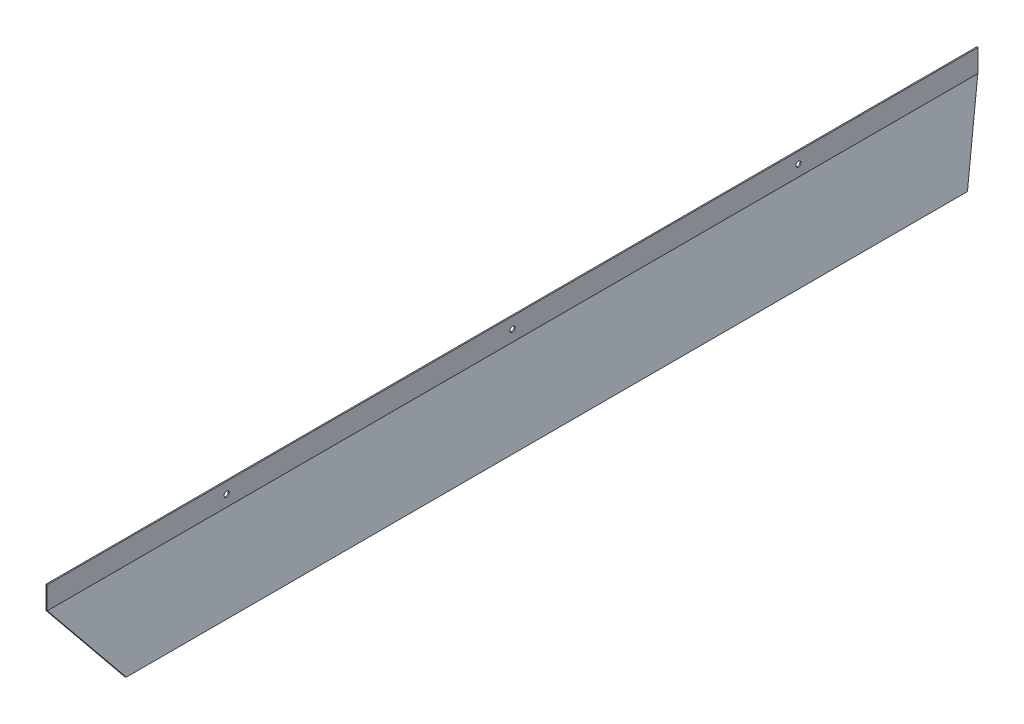
ISO-10303-21;
HEADER;
FILE_DESCRIPTION(('STEP AP214'),'2;1');
FILE_NAME('part.step','',(''),(''),'','','');
FILE_SCHEMA(('AUTOMOTIVE_DESIGN { 1 0 10303 214 1 1 1 1 }'));
ENDSEC;
DATA;
#1=APPLICATION_CONTEXT('core data for automotive mechanical design processes');
#2=APPLICATION_PROTOCOL_DEFINITION('international standard','automotive_design',2000,#1);
#3=PRODUCT_CONTEXT('',#1,'mechanical');
#4=PRODUCT('Part','Part','',(#3));
#5=PRODUCT_RELATED_PRODUCT_CATEGORY('part','',(#4));
#6=PRODUCT_DEFINITION_FORMATION('','',#4);
#7=PRODUCT_DEFINITION_CONTEXT('part definition',#1,'design');
#8=PRODUCT_DEFINITION('design','',#6,#7);
#9=PRODUCT_DEFINITION_SHAPE('','',#8);
#10=(LENGTH_UNIT() NAMED_UNIT(*) SI_UNIT(.MILLI.,.METRE.));
#11=(NAMED_UNIT(*) PLANE_ANGLE_UNIT() SI_UNIT($,.RADIAN.));
#12=(NAMED_UNIT(*) SI_UNIT($,.STERADIAN.) SOLID_ANGLE_UNIT());
#13=UNCERTAINTY_MEASURE_WITH_UNIT(LENGTH_MEASURE(1.E-05),#10,'distance_accuracy_value','');
#14=(GEOMETRIC_REPRESENTATION_CONTEXT(3) GLOBAL_UNCERTAINTY_ASSIGNED_CONTEXT((#13)) GLOBAL_UNIT_ASSIGNED_CONTEXT((#10,
#11,#12)) REPRESENTATION_CONTEXT('',''));
#15=CARTESIAN_POINT('',(0.,0.,0.));
#16=DIRECTION('',(0.,0.,1.));
#17=DIRECTION('',(1.,0.,0.));
#18=AXIS2_PLACEMENT_3D('',#15,#16,#17);
#19=CARTESIAN_POINT('',(0.,0.,-1628.));
#20=DIRECTION('',(1.,0.,0.));
#21=DIRECTION('',(0.,0.,-1.));
#22=AXIS2_PLACEMENT_3D('',#19,#20,#21);
#23=PLANE('',#22);
#24=DIRECTION('',(0.,-0.876889628932195,0.480691770962596));
#25=VECTOR('',#24,1.);
#26=CARTESIAN_POINT('',(0.,0.134693205403793,-1627.75428937618));
#27=LINE('',#26,#25);
#28=CARTESIAN_POINT('',(0.,0.582924506120358,-1628.));
#29=VERTEX_POINT('',#28);
#30=CARTESIAN_POINT('',(0.,0.,-1627.68045349843));
#31=VERTEX_POINT('',#30);
#32=EDGE_CURVE('E164',#29,#31,#27,.T.);
#33=ORIENTED_EDGE('',*,*,#32,.F.);
#34=DIRECTION('',(0.,1.,0.));
#35=VECTOR('',#34,1.);
#36=CARTESIAN_POINT('',(0.,0.,-1628.));
#37=LINE('',#36,#35);
#38=CARTESIAN_POINT('',(0.,39.4886186999102,-1628.));
#39=VERTEX_POINT('',#38);
#40=EDGE_CURVE('E81',#29,#39,#37,.T.);
#41=ORIENTED_EDGE('',*,*,#40,.T.);
#42=DIRECTION('',(0.,0.,1.));
#43=VECTOR('',#42,1.);
#44=CARTESIAN_POINT('',(0.,39.4886186999102,-1628.));
#45=LINE('',#44,#43);
#46=CARTESIAN_POINT('',(0.,39.4886186999102,0.));
#47=VERTEX_POINT('',#46);
#48=EDGE_CURVE('E134',#39,#47,#45,.T.);
#49=ORIENTED_EDGE('',*,*,#48,.T.);
#50=DIRECTION('',(0.,1.,0.));
#51=VECTOR('',#50,1.);
#52=CARTESIAN_POINT('',(0.,0.,0.));
#53=LINE('',#52,#51);
#54=CARTESIAN_POINT('',(0.,0.582924506120357,0.));
#55=VERTEX_POINT('',#54);
#56=EDGE_CURVE('E147',#55,#47,#53,.T.);
#57=ORIENTED_EDGE('',*,*,#56,.F.);
#58=DIRECTION('',(0.,0.876889628932195,0.480691770962596));
#59=VECTOR('',#58,1.);
#60=CARTESIAN_POINT('',(0.,-686.089494269602,-376.418844700459));
#61=LINE('',#60,#59);
#62=CARTESIAN_POINT('',(0.,1.11022302462516E-13,-0.319546501565626));
#63=VERTEX_POINT('',#62);
#64=EDGE_CURVE('E51',#63,#55,#61,.T.);
#65=ORIENTED_EDGE('',*,*,#64,.F.);
#66=DIRECTION('',(0.,0.,1.));
#67=VECTOR('',#66,1.);
#68=CARTESIAN_POINT('',(0.,0.,-1628.));
#69=LINE('',#68,#67);
#70=EDGE_CURVE('E128',#31,#63,#69,.T.);
#71=ORIENTED_EDGE('',*,*,#70,.F.);
#72=EDGE_LOOP('',(#33,#41,#49,#57,#65,#71));
#73=FACE_BOUND('',#72,.T.);
#74=CARTESIAN_POINT('',(0.,19.7443093499552,-314.));
#75=DIRECTION('',(1.,0.,0.));
#76=DIRECTION('',(0.,0.,-1.));
#77=AXIS2_PLACEMENT_3D('',#74,#75,#76);
#78=CIRCLE('',#77,4.4999999999999);
#79=CARTESIAN_POINT('',(0.,19.7443093499552,-318.5));
#80=VERTEX_POINT('',#79);
#81=EDGE_CURVE('E167',#80,#80,#78,.T.);
#82=ORIENTED_EDGE('',*,*,#81,.F.);
#83=EDGE_LOOP('',(#82));
#84=FACE_BOUND('',#83,.T.);
#85=CARTESIAN_POINT('',(0.,19.7443093499553,-1314.));
#86=DIRECTION('',(1.,0.,0.));
#87=DIRECTION('',(0.,0.,1.));
#88=AXIS2_PLACEMENT_3D('',#85,#86,#87);
#89=CIRCLE('',#88,4.50000000000001);
#90=CARTESIAN_POINT('',(0.,19.7443093499553,-1309.5));
#91=VERTEX_POINT('',#90);
#92=EDGE_CURVE('E160',#91,#91,#89,.T.);
#93=ORIENTED_EDGE('',*,*,#92,.F.);
#94=EDGE_LOOP('',(#93));
#95=FACE_BOUND('',#94,.T.);
#96=CARTESIAN_POINT('',(0.,19.7443093499552,-814.));
#97=DIRECTION('',(1.,0.,0.));
#98=DIRECTION('',(0.,0.,-1.));
#99=AXIS2_PLACEMENT_3D('',#96,#97,#98);
#100=CIRCLE('',#99,4.49999999999991);
#101=CARTESIAN_POINT('',(0.,19.7443093499552,-818.5));
#102=VERTEX_POINT('',#101);
#103=EDGE_CURVE('E154',#102,#102,#100,.T.);
#104=ORIENTED_EDGE('',*,*,#103,.F.);
#105=EDGE_LOOP('',(#104));
#106=FACE_BOUND('',#105,.T.);
#107=ADVANCED_FACE('F37',(#73,#84,#95,#106),#23,.T.);
#108=CARTESIAN_POINT('',(0.,0.,-1628.));
#109=DIRECTION('',(0.877268487978452,0.48,0.));
#110=DIRECTION('',(-0.48,0.877268487978452,0.));
#111=AXIS2_PLACEMENT_3D('',#108,#109,#110);
#112=PLANE('',#111);
#113=DIRECTION('',(0.407063086155084,-0.743965871048152,0.529919264233206));
#114=VECTOR('',#113,1.);
#115=CARTESIAN_POINT('',(-0.068929558349506,0.125978602979778,-1627.77018676605));
#116=LINE('',#115,#114);
#117=CARTESIAN_POINT('',(60.,-109.658560997307,-1549.57178450977));
#118=VERTEX_POINT('',#117);
#119=EDGE_CURVE('E106',#31,#118,#116,.T.);
#120=ORIENTED_EDGE('',*,*,#119,.F.);
#121=ORIENTED_EDGE('',*,*,#70,.T.);
#122=DIRECTION('',(-0.407063086155084,0.743965871048152,0.529919264233206));
#123=VECTOR('',#122,1.);
#124=CARTESIAN_POINT('',(351.107880211662,-641.699748313758,-457.395699747648));
#125=LINE('',#124,#123);
#126=CARTESIAN_POINT('',(60.,-109.658560997307,-78.4282154902318));
#127=VERTEX_POINT('',#126);
#128=EDGE_CURVE('E111',#127,#63,#125,.T.);
#129=ORIENTED_EDGE('',*,*,#128,.F.);
#130=DIRECTION('',(0.,0.,1.));
#131=VECTOR('',#130,1.);
#132=CARTESIAN_POINT('',(60.,-109.658560997307,-1628.));
#133=LINE('',#132,#131);
#134=EDGE_CURVE('E126',#118,#127,#133,.T.);
#135=ORIENTED_EDGE('',*,*,#134,.F.);
#136=EDGE_LOOP('',(#120,#121,#129,#135));
#137=FACE_BOUND('',#136,.T.);
#138=ADVANCED_FACE('F191',(#137),#112,.T.);
#139=CARTESIAN_POINT('',(58.2454630240431,-110.618560997307,-1628.));
#140=DIRECTION('',(0.480000000000009,-0.877268487978447,0.));
#141=DIRECTION('',(0.877268487978448,0.480000000000009,0.));
#142=AXIS2_PLACEMENT_3D('',#139,#140,#141);
#143=PLANE('',#142);
#144=DIRECTION('',(-0.877268487978452,-0.48,0.));
#145=VECTOR('',#144,1.);
#146=CARTESIAN_POINT('',(67.0181479038277,-105.818560997307,-1549.57178450977));
#147=LINE('',#146,#145);
#148=CARTESIAN_POINT('',(58.2454630240431,-110.618560997307,-1549.57178450977));
#149=VERTEX_POINT('',#148);
#150=EDGE_CURVE('E103',#118,#149,#147,.T.);
#151=ORIENTED_EDGE('',*,*,#150,.F.);
#152=ORIENTED_EDGE('',*,*,#134,.T.);
#153=DIRECTION('',(-0.877268487978452,-0.48,0.));
#154=VECTOR('',#153,1.);
#155=CARTESIAN_POINT('',(67.0181479038277,-105.818560997307,-78.4282154902318));
#156=LINE('',#155,#154);
#157=CARTESIAN_POINT('',(58.2454630240431,-110.618560997307,-78.4282154902318));
#158=VERTEX_POINT('',#157);
#159=EDGE_CURVE('E122',#127,#158,#156,.T.);
#160=ORIENTED_EDGE('',*,*,#159,.T.);
#161=DIRECTION('',(0.,0.,1.));
#162=VECTOR('',#161,1.);
#163=CARTESIAN_POINT('',(58.2454630240431,-110.618560997307,-1628.));
#164=LINE('',#163,#162);
#165=EDGE_CURVE('E118',#149,#158,#164,.T.);
#166=ORIENTED_EDGE('',*,*,#165,.F.);
#167=EDGE_LOOP('',(#151,#152,#160,#166));
#168=FACE_BOUND('',#167,.T.);
#169=ADVANCED_FACE('F125',(#168),#143,.T.);
#170=CARTESIAN_POINT('',(-2.,-0.511381300089771,-1628.));
#171=DIRECTION('',(-0.877268487978452,-0.48,0.));
#172=DIRECTION('',(0.48,-0.877268487978452,0.));
#173=AXIS2_PLACEMENT_3D('',#170,#171,#172);
#174=PLANE('',#173);
#175=DIRECTION('',(-0.407063086155084,0.743965871048152,-0.529919264233206));
#176=VECTOR('',#175,1.);
#177=CARTESIAN_POINT('',(-2.,-0.511381300089771,-1628.));
#178=LINE('',#177,#176);
#179=CARTESIAN_POINT('',(-2.,-0.511381300089771,-1628.));
#180=VERTEX_POINT('',#179);
#181=EDGE_CURVE('E60',#149,#180,#178,.T.);
#182=ORIENTED_EDGE('',*,*,#181,.F.);
#183=ORIENTED_EDGE('',*,*,#165,.T.);
#184=DIRECTION('',(0.407063086155084,-0.743965871048152,-0.529919264233206));
#185=VECTOR('',#184,1.);
#186=CARTESIAN_POINT('',(-2.,-0.511381300089771,0.));
#187=LINE('',#186,#185);
#188=CARTESIAN_POINT('',(-2.,-0.511381300089771,0.));
#189=VERTEX_POINT('',#188);
#190=EDGE_CURVE('E177',#189,#158,#187,.T.);
#191=ORIENTED_EDGE('',*,*,#190,.F.);
#192=DIRECTION('',(0.,0.,1.));
#193=VECTOR('',#192,1.);
#194=CARTESIAN_POINT('',(-2.,-0.511381300089771,-1628.));
#195=LINE('',#194,#193);
#196=EDGE_CURVE('E120',#180,#189,#195,.T.);
#197=ORIENTED_EDGE('',*,*,#196,.F.);
#198=EDGE_LOOP('',(#182,#183,#191,#197));
#199=FACE_BOUND('',#198,.T.);
#200=ADVANCED_FACE('F116',(#199),#174,.T.);
#201=CARTESIAN_POINT('',(-2.,-0.511381300089771,-1628.));
#202=DIRECTION('',(-1.,0.,0.));
#203=DIRECTION('',(0.,0.,1.));
#204=AXIS2_PLACEMENT_3D('',#201,#202,#203);
#205=PLANE('',#204);
#206=CARTESIAN_POINT('',(-2.,19.7443093499552,-314.));
#207=DIRECTION('',(1.,0.,0.));
#208=DIRECTION('',(0.,0.,-1.));
#209=AXIS2_PLACEMENT_3D('',#206,#207,#208);
#210=CIRCLE('',#209,4.4999999999999);
#211=CARTESIAN_POINT('',(-2.,19.7443093499552,-318.5));
#212=VERTEX_POINT('',#211);
#213=EDGE_CURVE('E157',#212,#212,#210,.T.);
#214=ORIENTED_EDGE('',*,*,#213,.T.);
#215=EDGE_LOOP('',(#214));
#216=FACE_BOUND('',#215,.T.);
#217=CARTESIAN_POINT('',(-2.,19.7443093499553,-1314.));
#218=DIRECTION('',(1.,0.,0.));
#219=DIRECTION('',(0.,0.,1.));
#220=AXIS2_PLACEMENT_3D('',#217,#218,#219);
#221=CIRCLE('',#220,4.50000000000001);
#222=CARTESIAN_POINT('',(-2.,19.7443093499553,-1309.5));
#223=VERTEX_POINT('',#222);
#224=EDGE_CURVE('E163',#223,#223,#221,.T.);
#225=ORIENTED_EDGE('',*,*,#224,.T.);
#226=EDGE_LOOP('',(#225));
#227=FACE_BOUND('',#226,.T.);
#228=CARTESIAN_POINT('',(-2.,19.7443093499552,-814.));
#229=DIRECTION('',(1.,0.,0.));
#230=DIRECTION('',(0.,0.,-1.));
#231=AXIS2_PLACEMENT_3D('',#228,#229,#230);
#232=CIRCLE('',#231,4.49999999999991);
#233=CARTESIAN_POINT('',(-2.,19.7443093499552,-818.5));
#234=VERTEX_POINT('',#233);
#235=EDGE_CURVE('E149',#234,#234,#232,.T.);
#236=ORIENTED_EDGE('',*,*,#235,.T.);
#237=EDGE_LOOP('',(#236));
#238=FACE_BOUND('',#237,.T.);
#239=DIRECTION('',(0.,-1.,0.));
#240=VECTOR('',#239,1.);
#241=CARTESIAN_POINT('',(-2.,-0.511381300089771,0.));
#242=LINE('',#241,#240);
#243=CARTESIAN_POINT('',(-2.,39.4886186999102,0.));
#244=VERTEX_POINT('',#243);
#245=EDGE_CURVE('E141',#244,#189,#242,.T.);
#246=ORIENTED_EDGE('',*,*,#245,.F.);
#247=DIRECTION('',(0.,0.,1.));
#248=VECTOR('',#247,1.);
#249=CARTESIAN_POINT('',(-2.,39.4886186999102,-1628.));
#250=LINE('',#249,#248);
#251=CARTESIAN_POINT('',(-2.,39.4886186999102,-1628.));
#252=VERTEX_POINT('',#251);
#253=EDGE_CURVE('E74',#252,#244,#250,.T.);
#254=ORIENTED_EDGE('',*,*,#253,.F.);
#255=DIRECTION('',(0.,-1.,0.));
#256=VECTOR('',#255,1.);
#257=CARTESIAN_POINT('',(-2.,-0.511381300089771,-1628.));
#258=LINE('',#257,#256);
#259=EDGE_CURVE('E135',#252,#180,#258,.T.);
#260=ORIENTED_EDGE('',*,*,#259,.T.);
#261=ORIENTED_EDGE('',*,*,#196,.T.);
#262=EDGE_LOOP('',(#246,#254,#260,#261));
#263=FACE_BOUND('',#262,.T.);
#264=ADVANCED_FACE('F180',(#216,#227,#238,#263),#205,.T.);
#265=CARTESIAN_POINT('',(0.,39.4886186999102,-1628.));
#266=DIRECTION('',(0.,1.,0.));
#267=DIRECTION('',(-1.,0.,0.));
#268=AXIS2_PLACEMENT_3D('',#265,#266,#267);
#269=PLANE('',#268);
#270=DIRECTION('',(-1.,0.,0.));
#271=VECTOR('',#270,1.);
#272=CARTESIAN_POINT('',(0.,39.4886186999102,0.));
#273=LINE('',#272,#271);
#274=EDGE_CURVE('E144',#47,#244,#273,.T.);
#275=ORIENTED_EDGE('',*,*,#274,.F.);
#276=ORIENTED_EDGE('',*,*,#48,.F.);
#277=DIRECTION('',(-1.,0.,0.));
#278=VECTOR('',#277,1.);
#279=CARTESIAN_POINT('',(0.,39.4886186999102,-1628.));
#280=LINE('',#279,#278);
#281=EDGE_CURVE('E151',#39,#252,#280,.T.);
#282=ORIENTED_EDGE('',*,*,#281,.T.);
#283=ORIENTED_EDGE('',*,*,#253,.T.);
#284=EDGE_LOOP('',(#275,#276,#282,#283));
#285=FACE_BOUND('',#284,.T.);
#286=ADVANCED_FACE('F185',(#285),#269,.T.);
#287=CARTESIAN_POINT('',(0.,0.,-1628.));
#288=DIRECTION('',(0.,0.,1.));
#289=DIRECTION('',(1.,0.,0.));
#290=AXIS2_PLACEMENT_3D('',#287,#288,#289);
#291=PLANE('',#290);
#292=ORIENTED_EDGE('',*,*,#40,.F.);
#293=DIRECTION('',(-0.877268487978452,-0.48,0.));
#294=VECTOR('',#293,1.);
#295=CARTESIAN_POINT('',(-0.2454630240431,0.448618699910227,-1628.));
#296=LINE('',#295,#294);
#297=EDGE_CURVE('E11',#29,#180,#296,.T.);
#298=ORIENTED_EDGE('',*,*,#297,.T.);
#299=ORIENTED_EDGE('',*,*,#259,.F.);
#300=ORIENTED_EDGE('',*,*,#281,.F.);
#301=EDGE_LOOP('',(#292,#298,#299,#300));
#302=FACE_BOUND('',#301,.T.);
#303=ADVANCED_FACE('F188',(#302),#291,.F.);
#304=CARTESIAN_POINT('',(0.,0.,0.));
#305=DIRECTION('',(0.,0.,1.));
#306=DIRECTION('',(1.,0.,0.));
#307=AXIS2_PLACEMENT_3D('',#304,#305,#306);
#308=PLANE('',#307);
#309=DIRECTION('',(-0.877268487978452,-0.48,0.));
#310=VECTOR('',#309,1.);
#311=CARTESIAN_POINT('',(-0.2454630240431,0.448618699910227,0.));
#312=LINE('',#311,#310);
#313=EDGE_CURVE('E44',#55,#189,#312,.T.);
#314=ORIENTED_EDGE('',*,*,#313,.F.);
#315=ORIENTED_EDGE('',*,*,#56,.T.);
#316=ORIENTED_EDGE('',*,*,#274,.T.);
#317=ORIENTED_EDGE('',*,*,#245,.T.);
#318=EDGE_LOOP('',(#314,#315,#316,#317));
#319=FACE_BOUND('',#318,.T.);
#320=ADVANCED_FACE('F183',(#319),#308,.T.);
#321=CARTESIAN_POINT('',(-2.,19.7443093499552,-814.));
#322=DIRECTION('',(1.,0.,0.));
#323=DIRECTION('',(0.,0.,-1.));
#324=AXIS2_PLACEMENT_3D('',#321,#322,#323);
#325=CYLINDRICAL_SURFACE('',#324,4.49999999999991);
#326=ORIENTED_EDGE('',*,*,#235,.F.);
#327=EDGE_LOOP('',(#326));
#328=FACE_BOUND('',#327,.T.);
#329=ORIENTED_EDGE('',*,*,#103,.T.);
#330=EDGE_LOOP('',(#329));
#331=FACE_BOUND('',#330,.T.);
#332=ADVANCED_FACE('F198',(#328,#331),#325,.F.);
#333=CARTESIAN_POINT('',(-2.,19.7443093499553,-1314.));
#334=DIRECTION('',(1.,0.,0.));
#335=DIRECTION('',(0.,0.,-1.));
#336=AXIS2_PLACEMENT_3D('',#333,#334,#335);
#337=CYLINDRICAL_SURFACE('',#336,4.50000000000001);
#338=ORIENTED_EDGE('',*,*,#224,.F.);
#339=EDGE_LOOP('',(#338));
#340=FACE_BOUND('',#339,.T.);
#341=ORIENTED_EDGE('',*,*,#92,.T.);
#342=EDGE_LOOP('',(#341));
#343=FACE_BOUND('',#342,.T.);
#344=ADVANCED_FACE('F200',(#340,#343),#337,.F.);
#345=CARTESIAN_POINT('',(-2.,19.7443093499552,-314.));
#346=DIRECTION('',(1.,0.,0.));
#347=DIRECTION('',(0.,0.,-1.));
#348=AXIS2_PLACEMENT_3D('',#345,#346,#347);
#349=CYLINDRICAL_SURFACE('',#348,4.4999999999999);
#350=ORIENTED_EDGE('',*,*,#213,.F.);
#351=EDGE_LOOP('',(#350));
#352=FACE_BOUND('',#351,.T.);
#353=ORIENTED_EDGE('',*,*,#81,.T.);
#354=EDGE_LOOP('',(#353));
#355=FACE_BOUND('',#354,.T.);
#356=ADVANCED_FACE('F207',(#352,#355),#349,.F.);
#357=CARTESIAN_POINT('',(6.77268487978452,4.28861869991023,0.));
#358=DIRECTION('',(-0.254361246831939,0.464881471684518,-0.848048096156425));
#359=DIRECTION('',(0.,0.876889628932195,0.480691770962596));
#360=AXIS2_PLACEMENT_3D('',#357,#358,#359);
#361=PLANE('',#360);
#362=ORIENTED_EDGE('',*,*,#64,.T.);
#363=ORIENTED_EDGE('',*,*,#313,.T.);
#364=ORIENTED_EDGE('',*,*,#190,.T.);
#365=ORIENTED_EDGE('',*,*,#159,.F.);
#366=ORIENTED_EDGE('',*,*,#128,.T.);
#367=EDGE_LOOP('',(#362,#363,#364,#365,#366));
#368=FACE_BOUND('',#367,.T.);
#369=ADVANCED_FACE('F178',(#368),#361,.F.);
#370=CARTESIAN_POINT('',(6.77268487978452,4.28861869991023,-1628.));
#371=DIRECTION('',(-0.254361246831939,0.464881471684518,0.848048096156425));
#372=DIRECTION('',(0.,-0.876889628932195,0.480691770962596));
#373=AXIS2_PLACEMENT_3D('',#370,#371,#372);
#374=PLANE('',#373);
#375=ORIENTED_EDGE('',*,*,#32,.T.);
#376=ORIENTED_EDGE('',*,*,#119,.T.);
#377=ORIENTED_EDGE('',*,*,#150,.T.);
#378=ORIENTED_EDGE('',*,*,#181,.T.);
#379=ORIENTED_EDGE('',*,*,#297,.F.);
#380=EDGE_LOOP('',(#375,#376,#377,#378,#379));
#381=FACE_BOUND('',#380,.T.);
#382=ADVANCED_FACE('F104',(#381),#374,.F.);
#383=CLOSED_SHELL('',(#107,#138,#169,#200,#264,#286,#303,#320,#332,#344,#356,#369,#382));
#384=MANIFOLD_SOLID_BREP('B2',#383);
#385=ADVANCED_BREP_SHAPE_REPRESENTATION('',(#18,#384),#14);
#386=SHAPE_DEFINITION_REPRESENTATION(#9,#385);
ENDSEC;
END-ISO-10303-21;
